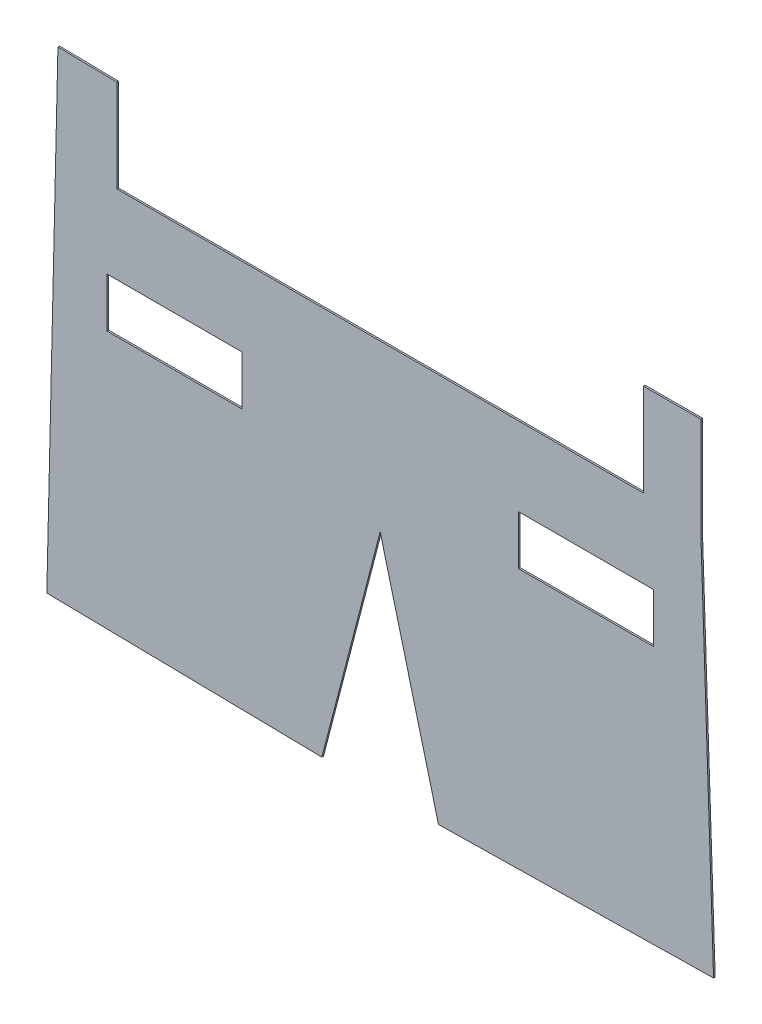
ISO-10303-21;
HEADER;
FILE_DESCRIPTION(('STEP AP214'),'2;1');
FILE_NAME('part.step','',(''),(''),'','','');
FILE_SCHEMA(('AUTOMOTIVE_DESIGN { 1 0 10303 214 1 1 1 1 }'));
ENDSEC;
DATA;
#1=APPLICATION_CONTEXT('core data for automotive mechanical design processes');
#2=APPLICATION_PROTOCOL_DEFINITION('international standard','automotive_design',2000,#1);
#3=PRODUCT_CONTEXT('',#1,'mechanical');
#4=PRODUCT('Part','Part','',(#3));
#5=PRODUCT_RELATED_PRODUCT_CATEGORY('part','',(#4));
#6=PRODUCT_DEFINITION_FORMATION('','',#4);
#7=PRODUCT_DEFINITION_CONTEXT('part definition',#1,'design');
#8=PRODUCT_DEFINITION('design','',#6,#7);
#9=PRODUCT_DEFINITION_SHAPE('','',#8);
#10=(LENGTH_UNIT() NAMED_UNIT(*) SI_UNIT(.MILLI.,.METRE.));
#11=(NAMED_UNIT(*) PLANE_ANGLE_UNIT() SI_UNIT($,.RADIAN.));
#12=(NAMED_UNIT(*) SI_UNIT($,.STERADIAN.) SOLID_ANGLE_UNIT());
#13=UNCERTAINTY_MEASURE_WITH_UNIT(LENGTH_MEASURE(1.E-05),#10,'distance_accuracy_value','');
#14=(GEOMETRIC_REPRESENTATION_CONTEXT(3) GLOBAL_UNCERTAINTY_ASSIGNED_CONTEXT((#13)) GLOBAL_UNIT_ASSIGNED_CONTEXT((#10,
#11,#12)) REPRESENTATION_CONTEXT('',''));
#15=CARTESIAN_POINT('',(0.,0.,0.));
#16=DIRECTION('',(0.,0.,1.));
#17=DIRECTION('',(1.,0.,0.));
#18=AXIS2_PLACEMENT_3D('',#15,#16,#17);
#19=CARTESIAN_POINT('',(0.,0.,0.1));
#20=DIRECTION('',(0.,0.,1.));
#21=DIRECTION('',(1.,0.,0.));
#22=AXIS2_PLACEMENT_3D('',#19,#20,#21);
#23=PLANE('',#22);
#24=DIRECTION('',(0.,1.,0.));
#25=VECTOR('',#24,1.);
#26=CARTESIAN_POINT('',(50.1249221538082,24.6176453174271,0.1));
#27=LINE('',#26,#25);
#28=CARTESIAN_POINT('',(50.1249221538082,19.6176453174271,0.1));
#29=VERTEX_POINT('',#28);
#30=CARTESIAN_POINT('',(50.1249221538082,25.928403199634,0.1));
#31=VERTEX_POINT('',#30);
#32=EDGE_CURVE('E237',#29,#31,#27,.T.);
#33=ORIENTED_EDGE('',*,*,#32,.T.);
#34=DIRECTION('',(-0.99999527288114,-0.00307477078417632,0.));
#35=VECTOR('',#34,1.);
#36=CARTESIAN_POINT('',(50.1249221538082,25.928403199634,0.1));
#37=LINE('',#36,#35);
#38=CARTESIAN_POINT('',(46.6261796106364,25.9176453174271,0.1));
#39=VERTEX_POINT('',#38);
#40=EDGE_CURVE('E240',#31,#39,#37,.T.);
#41=ORIENTED_EDGE('',*,*,#40,.T.);
#42=DIRECTION('',(0.,-1.,0.));
#43=VECTOR('',#42,1.);
#44=CARTESIAN_POINT('',(46.6261796106364,25.9176453174271,0.1));
#45=LINE('',#44,#43);
#46=CARTESIAN_POINT('',(46.6261796106364,20.2956793344448,0.1));
#47=VERTEX_POINT('',#46);
#48=EDGE_CURVE('E243',#39,#47,#45,.T.);
#49=ORIENTED_EDGE('',*,*,#48,.T.);
#50=DIRECTION('',(-1.,0.,0.));
#51=VECTOR('',#50,1.);
#52=CARTESIAN_POINT('',(46.6261796106364,20.2956793344448,0.1));
#53=LINE('',#52,#51);
#54=CARTESIAN_POINT('',(14.6261796106363,20.2956793344448,0.1));
#55=VERTEX_POINT('',#54);
#56=EDGE_CURVE('E245',#47,#55,#53,.T.);
#57=ORIENTED_EDGE('',*,*,#56,.T.);
#58=DIRECTION('',(0.,1.,0.));
#59=VECTOR('',#58,1.);
#60=CARTESIAN_POINT('',(14.6261796106363,20.2956793344448,0.1));
#61=LINE('',#60,#59);
#62=CARTESIAN_POINT('',(14.6261796106363,25.9176453174271,0.1));
#63=VERTEX_POINT('',#62);
#64=EDGE_CURVE('E247',#55,#63,#61,.T.);
#65=ORIENTED_EDGE('',*,*,#64,.T.);
#66=DIRECTION('',(-0.999856114026669,0.0169632321061609,0.));
#67=VECTOR('',#66,1.);
#68=CARTESIAN_POINT('',(11.0403741854373,25.9784809205323,0.1));
#69=LINE('',#68,#67);
#70=CARTESIAN_POINT('',(11.0403741854373,25.9784809205323,0.1));
#71=VERTEX_POINT('',#70);
#72=EDGE_CURVE('E249',#63,#71,#69,.T.);
#73=ORIENTED_EDGE('',*,*,#72,.T.);
#74=DIRECTION('',(-0.0232265296256662,-0.999730227772247,0.));
#75=VECTOR('',#74,1.);
#76=CARTESIAN_POINT('',(11.0403741854373,25.9784809205323,0.1));
#77=LINE('',#76,#75);
#78=CARTESIAN_POINT('',(10.3647181865335,-3.10351008570954,0.1));
#79=VERTEX_POINT('',#78);
#80=EDGE_CURVE('E251',#71,#79,#77,.T.);
#81=ORIENTED_EDGE('',*,*,#80,.T.);
#82=DIRECTION('',(0.999861628794548,-0.0166350011816528,0.));
#83=VECTOR('',#82,1.);
#84=CARTESIAN_POINT('',(10.3647181865335,-3.10351008570954,0.1));
#85=LINE('',#84,#83);
#86=CARTESIAN_POINT('',(27.0830016062318,-3.38165723770814,0.1));
#87=VERTEX_POINT('',#86);
#88=EDGE_CURVE('E253',#79,#87,#85,.T.);
#89=ORIENTED_EDGE('',*,*,#88,.T.);
#90=DIRECTION('',(0.251557642221312,0.967842318066354,0.));
#91=VECTOR('',#90,1.);
#92=CARTESIAN_POINT('',(27.0830016062318,-3.38165723770814,0.1));
#93=LINE('',#92,#91);
#94=CARTESIAN_POINT('',(30.6261796106361,10.2503580046968,0.1));
#95=VERTEX_POINT('',#94);
#96=EDGE_CURVE('E255',#87,#95,#93,.T.);
#97=ORIENTED_EDGE('',*,*,#96,.T.);
#98=DIRECTION('',(0.251557642221309,-0.967842318066355,0.));
#99=VECTOR('',#98,1.);
#100=CARTESIAN_POINT('',(30.6261796106361,10.2503580046968,0.1));
#101=LINE('',#100,#99);
#102=CARTESIAN_POINT('',(34.1693576150403,-3.38165723770814,0.1));
#103=VERTEX_POINT('',#102);
#104=EDGE_CURVE('E257',#95,#103,#101,.T.);
#105=ORIENTED_EDGE('',*,*,#104,.T.);
#106=DIRECTION('',(0.999861628794548,0.0166350011816522,0.));
#107=VECTOR('',#106,1.);
#108=CARTESIAN_POINT('',(50.8876410347387,-3.10351008570955,0.1));
#109=LINE('',#108,#107);
#110=CARTESIAN_POINT('',(50.8876410347387,-3.10351008570955,0.1));
#111=VERTEX_POINT('',#110);
#112=EDGE_CURVE('E259',#103,#111,#109,.T.);
#113=ORIENTED_EDGE('',*,*,#112,.T.);
#114=DIRECTION('',(-0.0335497686331388,0.999437048054885,0.));
#115=VECTOR('',#114,1.);
#116=CARTESIAN_POINT('',(50.8876410347387,-3.10351008570955,0.1));
#117=LINE('',#116,#115);
#118=EDGE_CURVE('E261',#111,#29,#117,.T.);
#119=ORIENTED_EDGE('',*,*,#118,.T.);
#120=EDGE_LOOP('',(#33,#41,#49,#57,#65,#73,#81,#89,#97,#105,#113,#119));
#121=FACE_BOUND('',#120,.T.);
#122=DIRECTION('',(-1.,0.,0.));
#123=VECTOR('',#122,1.);
#124=CARTESIAN_POINT('',(14.0261796106361,15.5176453174271,0.1));
#125=LINE('',#124,#123);
#126=CARTESIAN_POINT('',(22.2261796106361,15.5176453174271,0.1));
#127=VERTEX_POINT('',#126);
#128=CARTESIAN_POINT('',(14.0261796106361,15.5176453174271,0.1));
#129=VERTEX_POINT('',#128);
#130=EDGE_CURVE('E208',#127,#129,#125,.T.);
#131=ORIENTED_EDGE('',*,*,#130,.F.);
#132=DIRECTION('',(0.,1.,0.));
#133=VECTOR('',#132,1.);
#134=CARTESIAN_POINT('',(22.2261796106361,15.5176453174271,0.1));
#135=LINE('',#134,#133);
#136=CARTESIAN_POINT('',(22.2261796106361,12.5176453174271,0.1));
#137=VERTEX_POINT('',#136);
#138=EDGE_CURVE('E206',#137,#127,#135,.T.);
#139=ORIENTED_EDGE('',*,*,#138,.F.);
#140=DIRECTION('',(1.,0.,0.));
#141=VECTOR('',#140,1.);
#142=CARTESIAN_POINT('',(22.2261796106361,12.5176453174271,0.1));
#143=LINE('',#142,#141);
#144=CARTESIAN_POINT('',(14.0261796106361,12.5176453174271,0.1));
#145=VERTEX_POINT('',#144);
#146=EDGE_CURVE('E214',#145,#137,#143,.T.);
#147=ORIENTED_EDGE('',*,*,#146,.F.);
#148=DIRECTION('',(0.,-1.,0.));
#149=VECTOR('',#148,1.);
#150=CARTESIAN_POINT('',(14.0261796106361,12.5176453174271,0.1));
#151=LINE('',#150,#149);
#152=EDGE_CURVE('E211',#129,#145,#151,.T.);
#153=ORIENTED_EDGE('',*,*,#152,.F.);
#154=EDGE_LOOP('',(#131,#139,#147,#153));
#155=FACE_BOUND('',#154,.T.);
#156=DIRECTION('',(0.,1.,0.));
#157=VECTOR('',#156,1.);
#158=CARTESIAN_POINT('',(47.2261796106361,12.5176453174271,0.1));
#159=LINE('',#158,#157);
#160=CARTESIAN_POINT('',(47.2261796106361,12.5176453174271,0.1));
#161=VERTEX_POINT('',#160);
#162=CARTESIAN_POINT('',(47.2261796106361,15.5176453174271,0.1));
#163=VERTEX_POINT('',#162);
#164=EDGE_CURVE('E178',#161,#163,#159,.T.);
#165=ORIENTED_EDGE('',*,*,#164,.F.);
#166=DIRECTION('',(1.,0.,0.));
#167=VECTOR('',#166,1.);
#168=CARTESIAN_POINT('',(39.0261796106361,12.5176453174271,0.1));
#169=LINE('',#168,#167);
#170=CARTESIAN_POINT('',(39.0261796106361,12.5176453174271,0.1));
#171=VERTEX_POINT('',#170);
#172=EDGE_CURVE('E170',#171,#161,#169,.T.);
#173=ORIENTED_EDGE('',*,*,#172,.F.);
#174=DIRECTION('',(0.,-1.,0.));
#175=VECTOR('',#174,1.);
#176=CARTESIAN_POINT('',(39.0261796106361,15.5176453174271,0.1));
#177=LINE('',#176,#175);
#178=CARTESIAN_POINT('',(39.0261796106361,15.5176453174271,0.1));
#179=VERTEX_POINT('',#178);
#180=EDGE_CURVE('E192',#179,#171,#177,.T.);
#181=ORIENTED_EDGE('',*,*,#180,.F.);
#182=DIRECTION('',(-1.,0.,0.));
#183=VECTOR('',#182,1.);
#184=CARTESIAN_POINT('',(47.2261796106361,15.5176453174271,0.1));
#185=LINE('',#184,#183);
#186=EDGE_CURVE('E190',#163,#179,#185,.T.);
#187=ORIENTED_EDGE('',*,*,#186,.F.);
#188=EDGE_LOOP('',(#165,#173,#181,#187));
#189=FACE_BOUND('',#188,.T.);
#190=ADVANCED_FACE('F33',(#121,#155,#189),#23,.T.);
#191=CARTESIAN_POINT('',(0.,0.,0.));
#192=DIRECTION('',(0.,0.,1.));
#193=DIRECTION('',(1.,0.,0.));
#194=AXIS2_PLACEMENT_3D('',#191,#192,#193);
#195=PLANE('',#194);
#196=DIRECTION('',(0.,1.,0.));
#197=VECTOR('',#196,1.);
#198=CARTESIAN_POINT('',(22.2261796106361,15.5176453174271,0.));
#199=LINE('',#198,#197);
#200=CARTESIAN_POINT('',(22.2261796106361,12.5176453174271,0.));
#201=VERTEX_POINT('',#200);
#202=CARTESIAN_POINT('',(22.2261796106361,15.5176453174271,0.));
#203=VERTEX_POINT('',#202);
#204=EDGE_CURVE('E186',#201,#203,#199,.T.);
#205=ORIENTED_EDGE('',*,*,#204,.T.);
#206=DIRECTION('',(-1.,0.,0.));
#207=VECTOR('',#206,1.);
#208=CARTESIAN_POINT('',(14.0261796106361,15.5176453174271,0.));
#209=LINE('',#208,#207);
#210=CARTESIAN_POINT('',(14.0261796106361,15.5176453174271,0.));
#211=VERTEX_POINT('',#210);
#212=EDGE_CURVE('E219',#203,#211,#209,.T.);
#213=ORIENTED_EDGE('',*,*,#212,.T.);
#214=DIRECTION('',(0.,-1.,0.));
#215=VECTOR('',#214,1.);
#216=CARTESIAN_POINT('',(14.0261796106361,12.5176453174271,0.));
#217=LINE('',#216,#215);
#218=CARTESIAN_POINT('',(14.0261796106361,12.5176453174271,0.));
#219=VERTEX_POINT('',#218);
#220=EDGE_CURVE('E222',#211,#219,#217,.T.);
#221=ORIENTED_EDGE('',*,*,#220,.T.);
#222=DIRECTION('',(1.,0.,0.));
#223=VECTOR('',#222,1.);
#224=CARTESIAN_POINT('',(22.2261796106361,12.5176453174271,0.));
#225=LINE('',#224,#223);
#226=EDGE_CURVE('E209',#219,#201,#225,.T.);
#227=ORIENTED_EDGE('',*,*,#226,.T.);
#228=EDGE_LOOP('',(#205,#213,#221,#227));
#229=FACE_BOUND('',#228,.T.);
#230=DIRECTION('',(-0.99999527288114,-0.00307477078417632,0.));
#231=VECTOR('',#230,1.);
#232=CARTESIAN_POINT('',(50.1249221538082,25.928403199634,0.));
#233=LINE('',#232,#231);
#234=CARTESIAN_POINT('',(50.1249221538082,25.928403199634,0.));
#235=VERTEX_POINT('',#234);
#236=CARTESIAN_POINT('',(46.6261796106364,25.9176453174271,0.));
#237=VERTEX_POINT('',#236);
#238=EDGE_CURVE('E236',#235,#237,#233,.T.);
#239=ORIENTED_EDGE('',*,*,#238,.F.);
#240=DIRECTION('',(0.,1.,0.));
#241=VECTOR('',#240,1.);
#242=CARTESIAN_POINT('',(50.1249221538082,24.6176453174271,0.));
#243=LINE('',#242,#241);
#244=CARTESIAN_POINT('',(50.1249221538082,19.6176453174271,0.));
#245=VERTEX_POINT('',#244);
#246=EDGE_CURVE('E241',#245,#235,#243,.T.);
#247=ORIENTED_EDGE('',*,*,#246,.F.);
#248=DIRECTION('',(-0.0335497686331388,0.999437048054885,0.));
#249=VECTOR('',#248,1.);
#250=CARTESIAN_POINT('',(50.8876410347387,-3.10351008570955,0.));
#251=LINE('',#250,#249);
#252=CARTESIAN_POINT('',(50.8876410347387,-3.10351008570955,0.));
#253=VERTEX_POINT('',#252);
#254=EDGE_CURVE('E284',#253,#245,#251,.T.);
#255=ORIENTED_EDGE('',*,*,#254,.F.);
#256=DIRECTION('',(0.999861628794548,0.0166350011816522,0.));
#257=VECTOR('',#256,1.);
#258=CARTESIAN_POINT('',(50.8876410347387,-3.10351008570955,0.));
#259=LINE('',#258,#257);
#260=CARTESIAN_POINT('',(34.1693576150403,-3.38165723770814,0.));
#261=VERTEX_POINT('',#260);
#262=EDGE_CURVE('E282',#261,#253,#259,.T.);
#263=ORIENTED_EDGE('',*,*,#262,.F.);
#264=DIRECTION('',(0.251557642221309,-0.967842318066355,0.));
#265=VECTOR('',#264,1.);
#266=CARTESIAN_POINT('',(30.6261796106361,10.2503580046968,0.));
#267=LINE('',#266,#265);
#268=CARTESIAN_POINT('',(30.6261796106361,10.2503580046968,0.));
#269=VERTEX_POINT('',#268);
#270=EDGE_CURVE('E280',#269,#261,#267,.T.);
#271=ORIENTED_EDGE('',*,*,#270,.F.);
#272=DIRECTION('',(0.251557642221312,0.967842318066354,0.));
#273=VECTOR('',#272,1.);
#274=CARTESIAN_POINT('',(27.0830016062318,-3.38165723770814,0.));
#275=LINE('',#274,#273);
#276=CARTESIAN_POINT('',(27.0830016062318,-3.38165723770814,0.));
#277=VERTEX_POINT('',#276);
#278=EDGE_CURVE('E278',#277,#269,#275,.T.);
#279=ORIENTED_EDGE('',*,*,#278,.F.);
#280=DIRECTION('',(0.999861628794548,-0.0166350011816528,0.));
#281=VECTOR('',#280,1.);
#282=CARTESIAN_POINT('',(10.3647181865335,-3.10351008570954,0.));
#283=LINE('',#282,#281);
#284=CARTESIAN_POINT('',(10.3647181865335,-3.10351008570954,0.));
#285=VERTEX_POINT('',#284);
#286=EDGE_CURVE('E276',#285,#277,#283,.T.);
#287=ORIENTED_EDGE('',*,*,#286,.F.);
#288=DIRECTION('',(-0.0232265296256662,-0.999730227772247,0.));
#289=VECTOR('',#288,1.);
#290=CARTESIAN_POINT('',(11.0403741854373,25.9784809205323,0.));
#291=LINE('',#290,#289);
#292=CARTESIAN_POINT('',(11.0403741854373,25.9784809205323,0.));
#293=VERTEX_POINT('',#292);
#294=EDGE_CURVE('E274',#293,#285,#291,.T.);
#295=ORIENTED_EDGE('',*,*,#294,.F.);
#296=DIRECTION('',(-0.999856114026669,0.0169632321061609,0.));
#297=VECTOR('',#296,1.);
#298=CARTESIAN_POINT('',(11.0403741854373,25.9784809205323,0.));
#299=LINE('',#298,#297);
#300=CARTESIAN_POINT('',(14.6261796106363,25.9176453174271,0.));
#301=VERTEX_POINT('',#300);
#302=EDGE_CURVE('E272',#301,#293,#299,.T.);
#303=ORIENTED_EDGE('',*,*,#302,.F.);
#304=DIRECTION('',(0.,1.,0.));
#305=VECTOR('',#304,1.);
#306=CARTESIAN_POINT('',(14.6261796106363,20.2956793344448,0.));
#307=LINE('',#306,#305);
#308=CARTESIAN_POINT('',(14.6261796106363,20.2956793344448,0.));
#309=VERTEX_POINT('',#308);
#310=EDGE_CURVE('E270',#309,#301,#307,.T.);
#311=ORIENTED_EDGE('',*,*,#310,.F.);
#312=DIRECTION('',(-1.,0.,0.));
#313=VECTOR('',#312,1.);
#314=CARTESIAN_POINT('',(46.6261796106364,20.2956793344448,0.));
#315=LINE('',#314,#313);
#316=CARTESIAN_POINT('',(46.6261796106364,20.2956793344448,0.));
#317=VERTEX_POINT('',#316);
#318=EDGE_CURVE('E268',#317,#309,#315,.T.);
#319=ORIENTED_EDGE('',*,*,#318,.F.);
#320=DIRECTION('',(0.,-1.,0.));
#321=VECTOR('',#320,1.);
#322=CARTESIAN_POINT('',(46.6261796106364,25.9176453174271,0.));
#323=LINE('',#322,#321);
#324=EDGE_CURVE('E266',#237,#317,#323,.T.);
#325=ORIENTED_EDGE('',*,*,#324,.F.);
#326=EDGE_LOOP('',(#239,#247,#255,#263,#271,#279,#287,#295,#303,#311,#319,#325));
#327=FACE_BOUND('',#326,.T.);
#328=DIRECTION('',(1.,0.,0.));
#329=VECTOR('',#328,1.);
#330=CARTESIAN_POINT('',(39.0261796106361,12.5176453174271,0.));
#331=LINE('',#330,#329);
#332=CARTESIAN_POINT('',(39.0261796106361,12.5176453174271,0.));
#333=VERTEX_POINT('',#332);
#334=CARTESIAN_POINT('',(47.2261796106361,12.5176453174271,0.));
#335=VERTEX_POINT('',#334);
#336=EDGE_CURVE('E56',#333,#335,#331,.T.);
#337=ORIENTED_EDGE('',*,*,#336,.T.);
#338=DIRECTION('',(0.,1.,0.));
#339=VECTOR('',#338,1.);
#340=CARTESIAN_POINT('',(47.2261796106361,12.5176453174271,0.));
#341=LINE('',#340,#339);
#342=CARTESIAN_POINT('',(47.2261796106361,15.5176453174271,0.));
#343=VERTEX_POINT('',#342);
#344=EDGE_CURVE('E185',#335,#343,#341,.T.);
#345=ORIENTED_EDGE('',*,*,#344,.T.);
#346=DIRECTION('',(-1.,0.,0.));
#347=VECTOR('',#346,1.);
#348=CARTESIAN_POINT('',(47.2261796106361,15.5176453174271,0.));
#349=LINE('',#348,#347);
#350=CARTESIAN_POINT('',(39.0261796106361,15.5176453174271,0.));
#351=VERTEX_POINT('',#350);
#352=EDGE_CURVE('E198',#343,#351,#349,.T.);
#353=ORIENTED_EDGE('',*,*,#352,.T.);
#354=DIRECTION('',(0.,-1.,0.));
#355=VECTOR('',#354,1.);
#356=CARTESIAN_POINT('',(39.0261796106361,15.5176453174271,0.));
#357=LINE('',#356,#355);
#358=EDGE_CURVE('E179',#351,#333,#357,.T.);
#359=ORIENTED_EDGE('',*,*,#358,.T.);
#360=EDGE_LOOP('',(#337,#345,#353,#359));
#361=FACE_BOUND('',#360,.T.);
#362=ADVANCED_FACE('F326',(#229,#327,#361),#195,.F.);
#363=CARTESIAN_POINT('',(50.1249221538082,25.928403199634,0.1));
#364=DIRECTION('',(0.00307477078417632,-0.99999527288114,0.));
#365=DIRECTION('',(0.99999527288114,0.00307477078417632,0.));
#366=AXIS2_PLACEMENT_3D('',#363,#364,#365);
#367=PLANE('',#366);
#368=ORIENTED_EDGE('',*,*,#238,.T.);
#369=DIRECTION('',(0.,0.,-1.));
#370=VECTOR('',#369,1.);
#371=CARTESIAN_POINT('',(46.6261796106364,25.9176453174271,0.1));
#372=LINE('',#371,#370);
#373=EDGE_CURVE('E41',#39,#237,#372,.T.);
#374=ORIENTED_EDGE('',*,*,#373,.F.);
#375=ORIENTED_EDGE('',*,*,#40,.F.);
#376=DIRECTION('',(0.,0.,-1.));
#377=VECTOR('',#376,1.);
#378=CARTESIAN_POINT('',(50.1249221538082,25.928403199634,0.1));
#379=LINE('',#378,#377);
#380=EDGE_CURVE('E11',#31,#235,#379,.T.);
#381=ORIENTED_EDGE('',*,*,#380,.T.);
#382=EDGE_LOOP('',(#368,#374,#375,#381));
#383=FACE_BOUND('',#382,.T.);
#384=ADVANCED_FACE('F35',(#383),#367,.F.);
#385=CARTESIAN_POINT('',(46.6261796106364,25.9176453174271,0.1));
#386=DIRECTION('',(1.,0.,0.));
#387=DIRECTION('',(0.,1.,0.));
#388=AXIS2_PLACEMENT_3D('',#385,#386,#387);
#389=PLANE('',#388);
#390=ORIENTED_EDGE('',*,*,#324,.T.);
#391=DIRECTION('',(0.,0.,-1.));
#392=VECTOR('',#391,1.);
#393=CARTESIAN_POINT('',(46.6261796106364,20.2956793344448,0.1));
#394=LINE('',#393,#392);
#395=EDGE_CURVE('E313',#47,#317,#394,.T.);
#396=ORIENTED_EDGE('',*,*,#395,.F.);
#397=ORIENTED_EDGE('',*,*,#48,.F.);
#398=ORIENTED_EDGE('',*,*,#373,.T.);
#399=EDGE_LOOP('',(#390,#396,#397,#398));
#400=FACE_BOUND('',#399,.T.);
#401=ADVANCED_FACE('F320',(#400),#389,.F.);
#402=CARTESIAN_POINT('',(46.6261796106364,20.2956793344448,0.1));
#403=DIRECTION('',(0.,-1.,0.));
#404=DIRECTION('',(0.,0.,-1.));
#405=AXIS2_PLACEMENT_3D('',#402,#403,#404);
#406=PLANE('',#405);
#407=ORIENTED_EDGE('',*,*,#318,.T.);
#408=DIRECTION('',(0.,0.,-1.));
#409=VECTOR('',#408,1.);
#410=CARTESIAN_POINT('',(14.6261796106363,20.2956793344448,0.1));
#411=LINE('',#410,#409);
#412=EDGE_CURVE('E310',#55,#309,#411,.T.);
#413=ORIENTED_EDGE('',*,*,#412,.F.);
#414=ORIENTED_EDGE('',*,*,#56,.F.);
#415=ORIENTED_EDGE('',*,*,#395,.T.);
#416=EDGE_LOOP('',(#407,#413,#414,#415));
#417=FACE_BOUND('',#416,.T.);
#418=ADVANCED_FACE('F333',(#417),#406,.F.);
#419=CARTESIAN_POINT('',(14.6261796106363,20.2956793344448,0.1));
#420=DIRECTION('',(-1.,0.,0.));
#421=DIRECTION('',(0.,-1.,0.));
#422=AXIS2_PLACEMENT_3D('',#419,#420,#421);
#423=PLANE('',#422);
#424=ORIENTED_EDGE('',*,*,#310,.T.);
#425=DIRECTION('',(0.,0.,-1.));
#426=VECTOR('',#425,1.);
#427=CARTESIAN_POINT('',(14.6261796106363,25.9176453174271,0.1));
#428=LINE('',#427,#426);
#429=EDGE_CURVE('E307',#63,#301,#428,.T.);
#430=ORIENTED_EDGE('',*,*,#429,.F.);
#431=ORIENTED_EDGE('',*,*,#64,.F.);
#432=ORIENTED_EDGE('',*,*,#412,.T.);
#433=EDGE_LOOP('',(#424,#430,#431,#432));
#434=FACE_BOUND('',#433,.T.);
#435=ADVANCED_FACE('F337',(#434),#423,.F.);
#436=CARTESIAN_POINT('',(11.0403741854373,25.9784809205323,0.1));
#437=DIRECTION('',(-0.0169632321061609,-0.99985611402667,0.));
#438=DIRECTION('',(0.99985611402667,-0.0169632321061609,0.));
#439=AXIS2_PLACEMENT_3D('',#436,#437,#438);
#440=PLANE('',#439);
#441=ORIENTED_EDGE('',*,*,#302,.T.);
#442=DIRECTION('',(0.,0.,-1.));
#443=VECTOR('',#442,1.);
#444=CARTESIAN_POINT('',(11.0403741854373,25.9784809205323,0.1));
#445=LINE('',#444,#443);
#446=EDGE_CURVE('E304',#71,#293,#445,.T.);
#447=ORIENTED_EDGE('',*,*,#446,.F.);
#448=ORIENTED_EDGE('',*,*,#72,.F.);
#449=ORIENTED_EDGE('',*,*,#429,.T.);
#450=EDGE_LOOP('',(#441,#447,#448,#449));
#451=FACE_BOUND('',#450,.T.);
#452=ADVANCED_FACE('F377',(#451),#440,.F.);
#453=CARTESIAN_POINT('',(11.0403741854373,25.9784809205323,0.1));
#454=DIRECTION('',(0.999730227772247,-0.0232265296256662,0.));
#455=DIRECTION('',(0.0232265296256662,0.999730227772247,0.));
#456=AXIS2_PLACEMENT_3D('',#453,#454,#455);
#457=PLANE('',#456);
#458=ORIENTED_EDGE('',*,*,#294,.T.);
#459=DIRECTION('',(0.,0.,-1.));
#460=VECTOR('',#459,1.);
#461=CARTESIAN_POINT('',(10.3647181865335,-3.10351008570954,0.1));
#462=LINE('',#461,#460);
#463=EDGE_CURVE('E301',#79,#285,#462,.T.);
#464=ORIENTED_EDGE('',*,*,#463,.F.);
#465=ORIENTED_EDGE('',*,*,#80,.F.);
#466=ORIENTED_EDGE('',*,*,#446,.T.);
#467=EDGE_LOOP('',(#458,#464,#465,#466));
#468=FACE_BOUND('',#467,.T.);
#469=ADVANCED_FACE('F375',(#468),#457,.F.);
#470=CARTESIAN_POINT('',(10.3647181865335,-3.10351008570954,0.1));
#471=DIRECTION('',(0.0166350011816528,0.999861628794548,0.));
#472=DIRECTION('',(-0.999861628794548,0.0166350011816528,0.));
#473=AXIS2_PLACEMENT_3D('',#470,#471,#472);
#474=PLANE('',#473);
#475=ORIENTED_EDGE('',*,*,#286,.T.);
#476=DIRECTION('',(0.,0.,-1.));
#477=VECTOR('',#476,1.);
#478=CARTESIAN_POINT('',(27.0830016062318,-3.38165723770814,0.1));
#479=LINE('',#478,#477);
#480=EDGE_CURVE('E298',#87,#277,#479,.T.);
#481=ORIENTED_EDGE('',*,*,#480,.F.);
#482=ORIENTED_EDGE('',*,*,#88,.F.);
#483=ORIENTED_EDGE('',*,*,#463,.T.);
#484=EDGE_LOOP('',(#475,#481,#482,#483));
#485=FACE_BOUND('',#484,.T.);
#486=ADVANCED_FACE('F371',(#485),#474,.F.);
#487=CARTESIAN_POINT('',(27.0830016062318,-3.38165723770814,0.1));
#488=DIRECTION('',(-0.967842318066354,0.251557642221312,0.));
#489=DIRECTION('',(-0.251557642221312,-0.967842318066354,0.));
#490=AXIS2_PLACEMENT_3D('',#487,#488,#489);
#491=PLANE('',#490);
#492=ORIENTED_EDGE('',*,*,#278,.T.);
#493=DIRECTION('',(0.,0.,-1.));
#494=VECTOR('',#493,1.);
#495=CARTESIAN_POINT('',(30.6261796106361,10.2503580046968,0.1));
#496=LINE('',#495,#494);
#497=EDGE_CURVE('E295',#95,#269,#496,.T.);
#498=ORIENTED_EDGE('',*,*,#497,.F.);
#499=ORIENTED_EDGE('',*,*,#96,.F.);
#500=ORIENTED_EDGE('',*,*,#480,.T.);
#501=EDGE_LOOP('',(#492,#498,#499,#500));
#502=FACE_BOUND('',#501,.T.);
#503=ADVANCED_FACE('F366',(#502),#491,.F.);
#504=CARTESIAN_POINT('',(30.6261796106361,10.2503580046968,0.1));
#505=DIRECTION('',(0.967842318066355,0.251557642221309,0.));
#506=DIRECTION('',(-0.251557642221309,0.967842318066355,0.));
#507=AXIS2_PLACEMENT_3D('',#504,#505,#506);
#508=PLANE('',#507);
#509=ORIENTED_EDGE('',*,*,#270,.T.);
#510=DIRECTION('',(0.,0.,-1.));
#511=VECTOR('',#510,1.);
#512=CARTESIAN_POINT('',(34.1693576150403,-3.38165723770814,0.1));
#513=LINE('',#512,#511);
#514=EDGE_CURVE('E292',#103,#261,#513,.T.);
#515=ORIENTED_EDGE('',*,*,#514,.F.);
#516=ORIENTED_EDGE('',*,*,#104,.F.);
#517=ORIENTED_EDGE('',*,*,#497,.T.);
#518=EDGE_LOOP('',(#509,#515,#516,#517));
#519=FACE_BOUND('',#518,.T.);
#520=ADVANCED_FACE('F360',(#519),#508,.F.);
#521=CARTESIAN_POINT('',(50.8876410347387,-3.10351008570955,0.1));
#522=DIRECTION('',(-0.0166350011816522,0.999861628794548,0.));
#523=DIRECTION('',(-0.999861628794548,-0.0166350011816522,0.));
#524=AXIS2_PLACEMENT_3D('',#521,#522,#523);
#525=PLANE('',#524);
#526=ORIENTED_EDGE('',*,*,#262,.T.);
#527=DIRECTION('',(0.,0.,-1.));
#528=VECTOR('',#527,1.);
#529=CARTESIAN_POINT('',(50.8876410347387,-3.10351008570955,0.1));
#530=LINE('',#529,#528);
#531=EDGE_CURVE('E289',#111,#253,#530,.T.);
#532=ORIENTED_EDGE('',*,*,#531,.F.);
#533=ORIENTED_EDGE('',*,*,#112,.F.);
#534=ORIENTED_EDGE('',*,*,#514,.T.);
#535=EDGE_LOOP('',(#526,#532,#533,#534));
#536=FACE_BOUND('',#535,.T.);
#537=ADVANCED_FACE('F356',(#536),#525,.F.);
#538=CARTESIAN_POINT('',(50.8876410347387,-3.10351008570955,0.1));
#539=DIRECTION('',(-0.999437048054885,-0.0335497686331388,0.));
#540=DIRECTION('',(0.0335497686331388,-0.999437048054885,0.));
#541=AXIS2_PLACEMENT_3D('',#538,#539,#540);
#542=PLANE('',#541);
#543=ORIENTED_EDGE('',*,*,#254,.T.);
#544=DIRECTION('',(0.,0.,-1.));
#545=VECTOR('',#544,1.);
#546=CARTESIAN_POINT('',(50.1249221538082,19.6176453174271,0.1));
#547=LINE('',#546,#545);
#548=EDGE_CURVE('E264',#29,#245,#547,.T.);
#549=ORIENTED_EDGE('',*,*,#548,.F.);
#550=ORIENTED_EDGE('',*,*,#118,.F.);
#551=ORIENTED_EDGE('',*,*,#531,.T.);
#552=EDGE_LOOP('',(#543,#549,#550,#551));
#553=FACE_BOUND('',#552,.T.);
#554=ADVANCED_FACE('F351',(#553),#542,.F.);
#555=CARTESIAN_POINT('',(50.1249221538082,24.6176453174271,0.1));
#556=DIRECTION('',(-1.,0.,0.));
#557=DIRECTION('',(0.,0.,1.));
#558=AXIS2_PLACEMENT_3D('',#555,#556,#557);
#559=PLANE('',#558);
#560=ORIENTED_EDGE('',*,*,#246,.T.);
#561=ORIENTED_EDGE('',*,*,#380,.F.);
#562=ORIENTED_EDGE('',*,*,#32,.F.);
#563=ORIENTED_EDGE('',*,*,#548,.T.);
#564=EDGE_LOOP('',(#560,#561,#562,#563));
#565=FACE_BOUND('',#564,.T.);
#566=ADVANCED_FACE('F345',(#565),#559,.F.);
#567=CARTESIAN_POINT('',(22.2261796106361,15.5176453174271,0.1));
#568=DIRECTION('',(-1.,0.,0.));
#569=DIRECTION('',(0.,0.,1.));
#570=AXIS2_PLACEMENT_3D('',#567,#568,#569);
#571=PLANE('',#570);
#572=ORIENTED_EDGE('',*,*,#204,.F.);
#573=DIRECTION('',(0.,0.,-1.));
#574=VECTOR('',#573,1.);
#575=CARTESIAN_POINT('',(22.2261796106361,12.5176453174271,0.1));
#576=LINE('',#575,#574);
#577=EDGE_CURVE('E216',#137,#201,#576,.T.);
#578=ORIENTED_EDGE('',*,*,#577,.F.);
#579=ORIENTED_EDGE('',*,*,#138,.T.);
#580=DIRECTION('',(0.,0.,-1.));
#581=VECTOR('',#580,1.);
#582=CARTESIAN_POINT('',(22.2261796106361,15.5176453174271,0.1));
#583=LINE('',#582,#581);
#584=EDGE_CURVE('E233',#127,#203,#583,.T.);
#585=ORIENTED_EDGE('',*,*,#584,.T.);
#586=EDGE_LOOP('',(#572,#578,#579,#585));
#587=FACE_BOUND('',#586,.T.);
#588=ADVANCED_FACE('F394',(#587),#571,.T.);
#589=CARTESIAN_POINT('',(14.0261796106361,15.5176453174271,0.1));
#590=DIRECTION('',(0.,-1.,0.));
#591=DIRECTION('',(0.,0.,-1.));
#592=AXIS2_PLACEMENT_3D('',#589,#590,#591);
#593=PLANE('',#592);
#594=ORIENTED_EDGE('',*,*,#212,.F.);
#595=ORIENTED_EDGE('',*,*,#584,.F.);
#596=ORIENTED_EDGE('',*,*,#130,.T.);
#597=DIRECTION('',(0.,0.,-1.));
#598=VECTOR('',#597,1.);
#599=CARTESIAN_POINT('',(14.0261796106361,15.5176453174271,0.1));
#600=LINE('',#599,#598);
#601=EDGE_CURVE('E231',#129,#211,#600,.T.);
#602=ORIENTED_EDGE('',*,*,#601,.T.);
#603=EDGE_LOOP('',(#594,#595,#596,#602));
#604=FACE_BOUND('',#603,.T.);
#605=ADVANCED_FACE('F438',(#604),#593,.T.);
#606=CARTESIAN_POINT('',(14.0261796106361,12.5176453174271,0.1));
#607=DIRECTION('',(1.,0.,0.));
#608=DIRECTION('',(0.,0.,-1.));
#609=AXIS2_PLACEMENT_3D('',#606,#607,#608);
#610=PLANE('',#609);
#611=ORIENTED_EDGE('',*,*,#220,.F.);
#612=ORIENTED_EDGE('',*,*,#601,.F.);
#613=ORIENTED_EDGE('',*,*,#152,.T.);
#614=DIRECTION('',(0.,0.,-1.));
#615=VECTOR('',#614,1.);
#616=CARTESIAN_POINT('',(14.0261796106361,12.5176453174271,0.1));
#617=LINE('',#616,#615);
#618=EDGE_CURVE('E229',#145,#219,#617,.T.);
#619=ORIENTED_EDGE('',*,*,#618,.T.);
#620=EDGE_LOOP('',(#611,#612,#613,#619));
#621=FACE_BOUND('',#620,.T.);
#622=ADVANCED_FACE('F445',(#621),#610,.T.);
#623=CARTESIAN_POINT('',(22.2261796106361,12.5176453174271,0.1));
#624=DIRECTION('',(0.,1.,0.));
#625=DIRECTION('',(0.,0.,1.));
#626=AXIS2_PLACEMENT_3D('',#623,#624,#625);
#627=PLANE('',#626);
#628=ORIENTED_EDGE('',*,*,#226,.F.);
#629=ORIENTED_EDGE('',*,*,#618,.F.);
#630=ORIENTED_EDGE('',*,*,#146,.T.);
#631=ORIENTED_EDGE('',*,*,#577,.T.);
#632=EDGE_LOOP('',(#628,#629,#630,#631));
#633=FACE_BOUND('',#632,.T.);
#634=ADVANCED_FACE('F452',(#633),#627,.T.);
#635=CARTESIAN_POINT('',(39.0261796106361,12.5176453174271,0.1));
#636=DIRECTION('',(0.,1.,0.));
#637=DIRECTION('',(0.,0.,1.));
#638=AXIS2_PLACEMENT_3D('',#635,#636,#637);
#639=PLANE('',#638);
#640=ORIENTED_EDGE('',*,*,#336,.F.);
#641=DIRECTION('',(0.,0.,-1.));
#642=VECTOR('',#641,1.);
#643=CARTESIAN_POINT('',(39.0261796106361,12.5176453174271,0.1));
#644=LINE('',#643,#642);
#645=EDGE_CURVE('E174',#171,#333,#644,.T.);
#646=ORIENTED_EDGE('',*,*,#645,.F.);
#647=ORIENTED_EDGE('',*,*,#172,.T.);
#648=DIRECTION('',(0.,0.,-1.));
#649=VECTOR('',#648,1.);
#650=CARTESIAN_POINT('',(47.2261796106361,12.5176453174271,0.1));
#651=LINE('',#650,#649);
#652=EDGE_CURVE('E173',#161,#335,#651,.T.);
#653=ORIENTED_EDGE('',*,*,#652,.T.);
#654=EDGE_LOOP('',(#640,#646,#647,#653));
#655=FACE_BOUND('',#654,.T.);
#656=ADVANCED_FACE('F172',(#655),#639,.T.);
#657=CARTESIAN_POINT('',(47.2261796106361,12.5176453174271,0.1));
#658=DIRECTION('',(-1.,0.,0.));
#659=DIRECTION('',(0.,-1.,0.));
#660=AXIS2_PLACEMENT_3D('',#657,#658,#659);
#661=PLANE('',#660);
#662=ORIENTED_EDGE('',*,*,#344,.F.);
#663=ORIENTED_EDGE('',*,*,#652,.F.);
#664=ORIENTED_EDGE('',*,*,#164,.T.);
#665=DIRECTION('',(0.,0.,-1.));
#666=VECTOR('',#665,1.);
#667=CARTESIAN_POINT('',(47.2261796106361,15.5176453174271,0.1));
#668=LINE('',#667,#666);
#669=EDGE_CURVE('E187',#163,#343,#668,.T.);
#670=ORIENTED_EDGE('',*,*,#669,.T.);
#671=EDGE_LOOP('',(#662,#663,#664,#670));
#672=FACE_BOUND('',#671,.T.);
#673=ADVANCED_FACE('F182',(#672),#661,.T.);
#674=CARTESIAN_POINT('',(47.2261796106361,15.5176453174271,0.1));
#675=DIRECTION('',(0.,-1.,0.));
#676=DIRECTION('',(0.,0.,-1.));
#677=AXIS2_PLACEMENT_3D('',#674,#675,#676);
#678=PLANE('',#677);
#679=ORIENTED_EDGE('',*,*,#352,.F.);
#680=ORIENTED_EDGE('',*,*,#669,.F.);
#681=ORIENTED_EDGE('',*,*,#186,.T.);
#682=DIRECTION('',(0.,0.,-1.));
#683=VECTOR('',#682,1.);
#684=CARTESIAN_POINT('',(39.0261796106361,15.5176453174271,0.1));
#685=LINE('',#684,#683);
#686=EDGE_CURVE('E48',#179,#351,#685,.T.);
#687=ORIENTED_EDGE('',*,*,#686,.T.);
#688=EDGE_LOOP('',(#679,#680,#681,#687));
#689=FACE_BOUND('',#688,.T.);
#690=ADVANCED_FACE('F473',(#689),#678,.T.);
#691=CARTESIAN_POINT('',(39.0261796106361,15.5176453174271,0.1));
#692=DIRECTION('',(1.,0.,0.));
#693=DIRECTION('',(0.,1.,0.));
#694=AXIS2_PLACEMENT_3D('',#691,#692,#693);
#695=PLANE('',#694);
#696=ORIENTED_EDGE('',*,*,#358,.F.);
#697=ORIENTED_EDGE('',*,*,#686,.F.);
#698=ORIENTED_EDGE('',*,*,#180,.T.);
#699=ORIENTED_EDGE('',*,*,#645,.T.);
#700=EDGE_LOOP('',(#696,#697,#698,#699));
#701=FACE_BOUND('',#700,.T.);
#702=ADVANCED_FACE('F480',(#701),#695,.T.);
#703=CLOSED_SHELL('',(#190,#362,#384,#401,#418,#435,#452,#469,#486,#503,#520,#537,#554,#566,
#588,#605,#622,#634,#656,#673,#690,#702));
#704=MANIFOLD_SOLID_BREP('B2',#703);
#705=ADVANCED_BREP_SHAPE_REPRESENTATION('',(#18,#704),#14);
#706=SHAPE_DEFINITION_REPRESENTATION(#9,#705);
ENDSEC;
END-ISO-10303-21;
